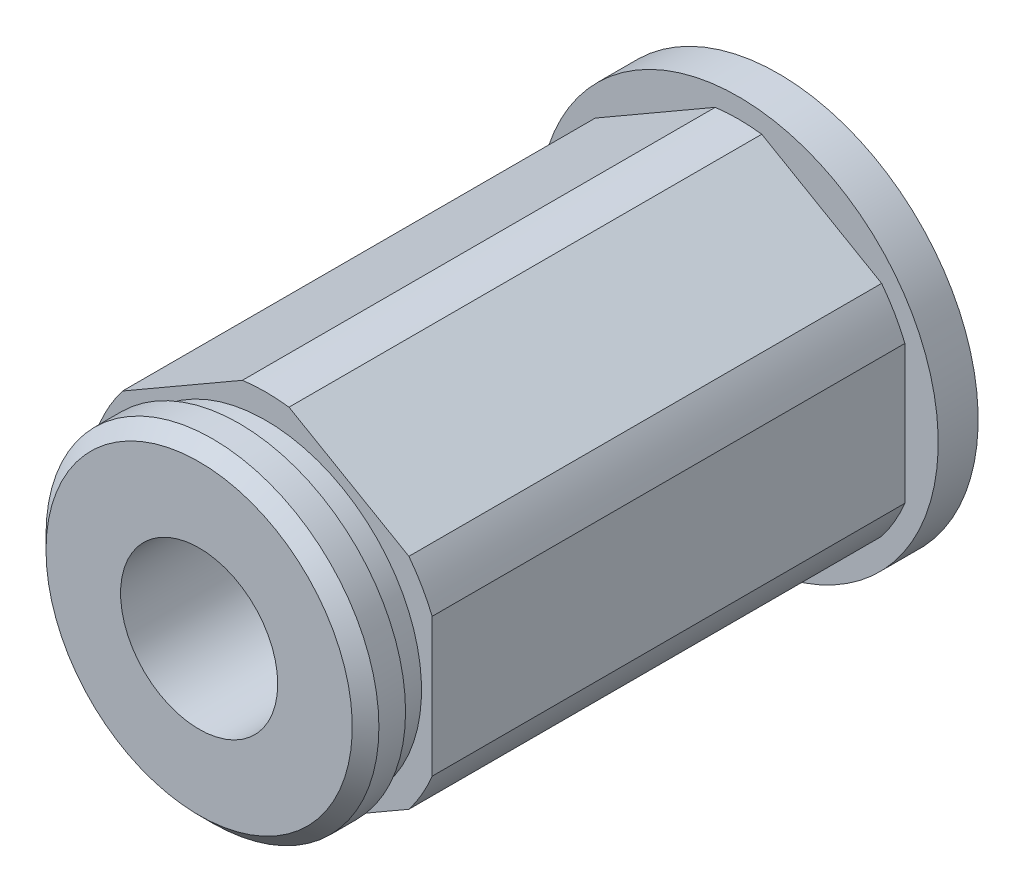
ISO-10303-21;
HEADER;
FILE_DESCRIPTION(('STEP AP214'),'2;1');
FILE_NAME('part.step','',(''),(''),'','','');
FILE_SCHEMA(('AUTOMOTIVE_DESIGN { 1 0 10303 214 1 1 1 1 }'));
ENDSEC;
DATA;
#1=APPLICATION_CONTEXT('core data for automotive mechanical design processes');
#2=APPLICATION_PROTOCOL_DEFINITION('international standard','automotive_design',2000,#1);
#3=PRODUCT_CONTEXT('',#1,'mechanical');
#4=PRODUCT('Part','Part','',(#3));
#5=PRODUCT_RELATED_PRODUCT_CATEGORY('part','',(#4));
#6=PRODUCT_DEFINITION_FORMATION('','',#4);
#7=PRODUCT_DEFINITION_CONTEXT('part definition',#1,'design');
#8=PRODUCT_DEFINITION('design','',#6,#7);
#9=PRODUCT_DEFINITION_SHAPE('','',#8);
#10=(LENGTH_UNIT() NAMED_UNIT(*) SI_UNIT(.MILLI.,.METRE.));
#11=(NAMED_UNIT(*) PLANE_ANGLE_UNIT() SI_UNIT($,.RADIAN.));
#12=(NAMED_UNIT(*) SI_UNIT($,.STERADIAN.) SOLID_ANGLE_UNIT());
#13=UNCERTAINTY_MEASURE_WITH_UNIT(LENGTH_MEASURE(1.E-05),#10,'distance_accuracy_value','');
#14=(GEOMETRIC_REPRESENTATION_CONTEXT(3) GLOBAL_UNCERTAINTY_ASSIGNED_CONTEXT((#13)) GLOBAL_UNIT_ASSIGNED_CONTEXT((#10,
#11,#12)) REPRESENTATION_CONTEXT('',''));
#15=CARTESIAN_POINT('',(0.,0.,0.));
#16=DIRECTION('',(0.,0.,1.));
#17=DIRECTION('',(1.,0.,0.));
#18=AXIS2_PLACEMENT_3D('',#15,#16,#17);
#19=CARTESIAN_POINT('',(-0.88841137786549,6.81942387054648,9.779));
#20=DIRECTION('',(0.5,-0.866025403784439,0.));
#21=DIRECTION('',(0.866025403784439,0.5,0.));
#22=AXIS2_PLACEMENT_3D('',#19,#20,#21);
#23=PLANE('',#22);
#24=DIRECTION('',(0.866025403784439,0.5,0.));
#25=VECTOR('',#24,1.);
#26=CARTESIAN_POINT('',(-0.88841137786549,6.81942387054648,-8.255));
#27=LINE('',#26,#25);
#28=CARTESIAN_POINT('',(-5.46158862213451,4.17909875751589,-8.255));
#29=VERTEX_POINT('',#28);
#30=CARTESIAN_POINT('',(-0.88841137786549,6.81942387054648,-8.255));
#31=VERTEX_POINT('',#30);
#32=EDGE_CURVE('E164',#29,#31,#27,.T.);
#33=ORIENTED_EDGE('',*,*,#32,.F.);
#34=DIRECTION('',(0.,0.,-1.));
#35=VECTOR('',#34,1.);
#36=CARTESIAN_POINT('',(-5.46158862213451,4.17909875751589,9.779));
#37=LINE('',#36,#35);
#38=CARTESIAN_POINT('',(-5.46158862213451,4.17909875751589,9.779));
#39=VERTEX_POINT('',#38);
#40=EDGE_CURVE('E46',#39,#29,#37,.T.);
#41=ORIENTED_EDGE('',*,*,#40,.F.);
#42=DIRECTION('',(-0.866025403784439,-0.5,0.));
#43=VECTOR('',#42,1.);
#44=CARTESIAN_POINT('',(-0.88841137786549,6.81942387054648,9.779));
#45=LINE('',#44,#43);
#46=CARTESIAN_POINT('',(-0.88841137786549,6.81942387054648,9.779));
#47=VERTEX_POINT('',#46);
#48=EDGE_CURVE('E205',#47,#39,#45,.T.);
#49=ORIENTED_EDGE('',*,*,#48,.F.);
#50=DIRECTION('',(0.,0.,-1.));
#51=VECTOR('',#50,1.);
#52=CARTESIAN_POINT('',(-0.88841137786549,6.81942387054648,9.779));
#53=LINE('',#52,#51);
#54=EDGE_CURVE('E11',#47,#31,#53,.T.);
#55=ORIENTED_EDGE('',*,*,#54,.T.);
#56=EDGE_LOOP('',(#33,#41,#49,#55));
#57=FACE_BOUND('',#56,.T.);
#58=ADVANCED_FACE('F38',(#57),#23,.F.);
#59=CARTESIAN_POINT('',(-6.35,2.64032511303059,9.779));
#60=DIRECTION('',(1.,0.,0.));
#61=DIRECTION('',(0.,0.,-1.));
#62=AXIS2_PLACEMENT_3D('',#59,#60,#61);
#63=PLANE('',#62);
#64=DIRECTION('',(0.,1.,0.));
#65=VECTOR('',#64,1.);
#66=CARTESIAN_POINT('',(-6.35,2.64032511303059,-8.255));
#67=LINE('',#66,#65);
#68=CARTESIAN_POINT('',(-6.35,-2.64032511303059,-8.255));
#69=VERTEX_POINT('',#68);
#70=CARTESIAN_POINT('',(-6.35,2.64032511303059,-8.255));
#71=VERTEX_POINT('',#70);
#72=EDGE_CURVE('E175',#69,#71,#67,.T.);
#73=ORIENTED_EDGE('',*,*,#72,.F.);
#74=DIRECTION('',(0.,0.,-1.));
#75=VECTOR('',#74,1.);
#76=CARTESIAN_POINT('',(-6.35,-2.64032511303059,9.779));
#77=LINE('',#76,#75);
#78=CARTESIAN_POINT('',(-6.35,-2.64032511303059,9.779));
#79=VERTEX_POINT('',#78);
#80=EDGE_CURVE('E243',#79,#69,#77,.T.);
#81=ORIENTED_EDGE('',*,*,#80,.F.);
#82=DIRECTION('',(0.,-1.,0.));
#83=VECTOR('',#82,1.);
#84=CARTESIAN_POINT('',(-6.35,2.64032511303059,9.779));
#85=LINE('',#84,#83);
#86=CARTESIAN_POINT('',(-6.35,2.64032511303059,9.779));
#87=VERTEX_POINT('',#86);
#88=EDGE_CURVE('E209',#87,#79,#85,.T.);
#89=ORIENTED_EDGE('',*,*,#88,.F.);
#90=DIRECTION('',(0.,0.,-1.));
#91=VECTOR('',#90,1.);
#92=CARTESIAN_POINT('',(-6.35,2.64032511303059,9.779));
#93=LINE('',#92,#91);
#94=EDGE_CURVE('E246',#87,#71,#93,.T.);
#95=ORIENTED_EDGE('',*,*,#94,.T.);
#96=EDGE_LOOP('',(#73,#81,#89,#95));
#97=FACE_BOUND('',#96,.T.);
#98=ADVANCED_FACE('F257',(#97),#63,.F.);
#99=CARTESIAN_POINT('',(-5.46158862213451,-4.17909875751589,9.779));
#100=DIRECTION('',(0.5,0.866025403784438,0.));
#101=DIRECTION('',(-0.866025403784439,0.5,0.));
#102=AXIS2_PLACEMENT_3D('',#99,#100,#101);
#103=PLANE('',#102);
#104=DIRECTION('',(-0.866025403784439,0.5,0.));
#105=VECTOR('',#104,1.);
#106=CARTESIAN_POINT('',(-5.46158862213451,-4.17909875751589,-8.255));
#107=LINE('',#106,#105);
#108=CARTESIAN_POINT('',(-0.888411377865495,-6.81942387054648,-8.255));
#109=VERTEX_POINT('',#108);
#110=CARTESIAN_POINT('',(-5.46158862213451,-4.17909875751589,-8.255));
#111=VERTEX_POINT('',#110);
#112=EDGE_CURVE('E173',#109,#111,#107,.T.);
#113=ORIENTED_EDGE('',*,*,#112,.F.);
#114=DIRECTION('',(0.,0.,-1.));
#115=VECTOR('',#114,1.);
#116=CARTESIAN_POINT('',(-0.888411377865495,-6.81942387054648,9.779));
#117=LINE('',#116,#115);
#118=CARTESIAN_POINT('',(-0.888411377865495,-6.81942387054648,9.779));
#119=VERTEX_POINT('',#118);
#120=EDGE_CURVE('E237',#119,#109,#117,.T.);
#121=ORIENTED_EDGE('',*,*,#120,.F.);
#122=DIRECTION('',(0.866025403784438,-0.5,0.));
#123=VECTOR('',#122,1.);
#124=CARTESIAN_POINT('',(-5.46158862213451,-4.17909875751589,9.779));
#125=LINE('',#124,#123);
#126=CARTESIAN_POINT('',(-5.46158862213451,-4.17909875751589,9.779));
#127=VERTEX_POINT('',#126);
#128=EDGE_CURVE('E213',#127,#119,#125,.T.);
#129=ORIENTED_EDGE('',*,*,#128,.F.);
#130=DIRECTION('',(0.,0.,-1.));
#131=VECTOR('',#130,1.);
#132=CARTESIAN_POINT('',(-5.46158862213451,-4.17909875751589,9.779));
#133=LINE('',#132,#131);
#134=EDGE_CURVE('E240',#127,#111,#133,.T.);
#135=ORIENTED_EDGE('',*,*,#134,.T.);
#136=EDGE_LOOP('',(#113,#121,#129,#135));
#137=FACE_BOUND('',#136,.T.);
#138=ADVANCED_FACE('F282',(#137),#103,.F.);
#139=CARTESIAN_POINT('',(0.88841137786549,-6.81942387054648,9.779));
#140=DIRECTION('',(-0.5,0.866025403784439,0.));
#141=DIRECTION('',(-0.866025403784439,-0.5,0.));
#142=AXIS2_PLACEMENT_3D('',#139,#140,#141);
#143=PLANE('',#142);
#144=DIRECTION('',(-0.866025403784439,-0.5,0.));
#145=VECTOR('',#144,1.);
#146=CARTESIAN_POINT('',(0.88841137786549,-6.81942387054648,-8.255));
#147=LINE('',#146,#145);
#148=CARTESIAN_POINT('',(5.46158862213451,-4.17909875751589,-8.255));
#149=VERTEX_POINT('',#148);
#150=CARTESIAN_POINT('',(0.888411377865487,-6.81942387054648,-8.255));
#151=VERTEX_POINT('',#150);
#152=EDGE_CURVE('E161',#149,#151,#147,.T.);
#153=ORIENTED_EDGE('',*,*,#152,.F.);
#154=DIRECTION('',(0.,0.,-1.));
#155=VECTOR('',#154,1.);
#156=CARTESIAN_POINT('',(5.46158862213451,-4.17909875751589,9.779));
#157=LINE('',#156,#155);
#158=CARTESIAN_POINT('',(5.46158862213451,-4.17909875751589,9.779));
#159=VERTEX_POINT('',#158);
#160=EDGE_CURVE('E231',#159,#149,#157,.T.);
#161=ORIENTED_EDGE('',*,*,#160,.F.);
#162=DIRECTION('',(0.866025403784439,0.5,0.));
#163=VECTOR('',#162,1.);
#164=CARTESIAN_POINT('',(0.88841137786549,-6.81942387054648,9.779));
#165=LINE('',#164,#163);
#166=CARTESIAN_POINT('',(0.888411377865487,-6.81942387054648,9.779));
#167=VERTEX_POINT('',#166);
#168=EDGE_CURVE('E217',#167,#159,#165,.T.);
#169=ORIENTED_EDGE('',*,*,#168,.F.);
#170=DIRECTION('',(0.,0.,-1.));
#171=VECTOR('',#170,1.);
#172=CARTESIAN_POINT('',(0.888411377865487,-6.81942387054648,9.779));
#173=LINE('',#172,#171);
#174=EDGE_CURVE('E234',#167,#151,#173,.T.);
#175=ORIENTED_EDGE('',*,*,#174,.T.);
#176=EDGE_LOOP('',(#153,#161,#169,#175));
#177=FACE_BOUND('',#176,.T.);
#178=ADVANCED_FACE('F276',(#177),#143,.F.);
#179=CARTESIAN_POINT('',(6.35,-2.64032511303059,9.779));
#180=DIRECTION('',(-1.,0.,0.));
#181=DIRECTION('',(0.,0.,1.));
#182=AXIS2_PLACEMENT_3D('',#179,#180,#181);
#183=PLANE('',#182);
#184=DIRECTION('',(0.,-1.,0.));
#185=VECTOR('',#184,1.);
#186=CARTESIAN_POINT('',(6.35,-2.64032511303059,-8.255));
#187=LINE('',#186,#185);
#188=CARTESIAN_POINT('',(6.35,2.64032511303059,-8.255));
#189=VERTEX_POINT('',#188);
#190=CARTESIAN_POINT('',(6.35,-2.64032511303059,-8.255));
#191=VERTEX_POINT('',#190);
#192=EDGE_CURVE('E142',#189,#191,#187,.T.);
#193=ORIENTED_EDGE('',*,*,#192,.F.);
#194=DIRECTION('',(0.,0.,-1.));
#195=VECTOR('',#194,1.);
#196=CARTESIAN_POINT('',(6.35,2.64032511303059,9.779));
#197=LINE('',#196,#195);
#198=CARTESIAN_POINT('',(6.35,2.64032511303059,9.779));
#199=VERTEX_POINT('',#198);
#200=EDGE_CURVE('E129',#199,#189,#197,.T.);
#201=ORIENTED_EDGE('',*,*,#200,.F.);
#202=DIRECTION('',(0.,1.,0.));
#203=VECTOR('',#202,1.);
#204=CARTESIAN_POINT('',(6.35,-2.64032511303059,9.779));
#205=LINE('',#204,#203);
#206=CARTESIAN_POINT('',(6.35,-2.64032511303059,9.779));
#207=VERTEX_POINT('',#206);
#208=EDGE_CURVE('E222',#207,#199,#205,.T.);
#209=ORIENTED_EDGE('',*,*,#208,.F.);
#210=DIRECTION('',(0.,0.,-1.));
#211=VECTOR('',#210,1.);
#212=CARTESIAN_POINT('',(6.35,-2.64032511303059,9.779));
#213=LINE('',#212,#211);
#214=EDGE_CURVE('E137',#207,#191,#213,.T.);
#215=ORIENTED_EDGE('',*,*,#214,.T.);
#216=EDGE_LOOP('',(#193,#201,#209,#215));
#217=FACE_BOUND('',#216,.T.);
#218=ADVANCED_FACE('F143',(#217),#183,.F.);
#219=CARTESIAN_POINT('',(5.46158862213451,4.17909875751589,9.779));
#220=DIRECTION('',(-0.499999999999999,-0.866025403784439,0.));
#221=DIRECTION('',(0.866025403784439,-0.499999999999999,0.));
#222=AXIS2_PLACEMENT_3D('',#219,#220,#221);
#223=PLANE('',#222);
#224=DIRECTION('',(0.866025403784439,-0.499999999999999,0.));
#225=VECTOR('',#224,1.);
#226=CARTESIAN_POINT('',(5.46158862213451,4.17909875751589,-8.255));
#227=LINE('',#226,#225);
#228=CARTESIAN_POINT('',(0.888411377865485,6.81942387054648,-8.255));
#229=VERTEX_POINT('',#228);
#230=CARTESIAN_POINT('',(5.46158862213451,4.17909875751589,-8.255));
#231=VERTEX_POINT('',#230);
#232=EDGE_CURVE('E53',#229,#231,#227,.T.);
#233=ORIENTED_EDGE('',*,*,#232,.F.);
#234=DIRECTION('',(0.,0.,-1.));
#235=VECTOR('',#234,1.);
#236=CARTESIAN_POINT('',(0.888411377865485,6.81942387054648,9.779));
#237=LINE('',#236,#235);
#238=CARTESIAN_POINT('',(0.888411377865485,6.81942387054648,9.779));
#239=VERTEX_POINT('',#238);
#240=EDGE_CURVE('E227',#239,#229,#237,.T.);
#241=ORIENTED_EDGE('',*,*,#240,.F.);
#242=DIRECTION('',(-0.866025403784439,0.499999999999999,0.));
#243=VECTOR('',#242,1.);
#244=CARTESIAN_POINT('',(5.46158862213451,4.17909875751589,9.779));
#245=LINE('',#244,#243);
#246=CARTESIAN_POINT('',(5.46158862213451,4.17909875751589,9.779));
#247=VERTEX_POINT('',#246);
#248=EDGE_CURVE('E225',#247,#239,#245,.T.);
#249=ORIENTED_EDGE('',*,*,#248,.F.);
#250=DIRECTION('',(0.,0.,-1.));
#251=VECTOR('',#250,1.);
#252=CARTESIAN_POINT('',(5.46158862213451,4.17909875751589,9.779));
#253=LINE('',#252,#251);
#254=EDGE_CURVE('E138',#247,#231,#253,.T.);
#255=ORIENTED_EDGE('',*,*,#254,.T.);
#256=EDGE_LOOP('',(#233,#241,#249,#255));
#257=FACE_BOUND('',#256,.T.);
#258=ADVANCED_FACE('F269',(#257),#223,.F.);
#259=CARTESIAN_POINT('',(0.,0.,9.779));
#260=DIRECTION('',(0.,0.,-1.));
#261=DIRECTION('',(-1.,0.,0.));
#262=AXIS2_PLACEMENT_3D('',#259,#260,#261);
#263=CYLINDRICAL_SURFACE('',#262,6.87705);
#264=CARTESIAN_POINT('',(0.,0.,-8.255));
#265=DIRECTION('',(0.,0.,-1.));
#266=DIRECTION('',(-1.,0.,0.));
#267=AXIS2_PLACEMENT_3D('',#264,#265,#266);
#268=CIRCLE('',#267,6.87705);
#269=EDGE_CURVE('E60',#31,#229,#268,.T.);
#270=ORIENTED_EDGE('',*,*,#269,.F.);
#271=ORIENTED_EDGE('',*,*,#54,.F.);
#272=CARTESIAN_POINT('',(0.,0.,9.779));
#273=DIRECTION('',(0.,0.,1.));
#274=DIRECTION('',(1.,0.,0.));
#275=AXIS2_PLACEMENT_3D('',#272,#273,#274);
#276=CIRCLE('',#275,6.87705);
#277=EDGE_CURVE('E202',#239,#47,#276,.T.);
#278=ORIENTED_EDGE('',*,*,#277,.F.);
#279=ORIENTED_EDGE('',*,*,#240,.T.);
#280=EDGE_LOOP('',(#270,#271,#278,#279));
#281=FACE_BOUND('',#280,.T.);
#282=ADVANCED_FACE('F267',(#281),#263,.T.);
#283=CARTESIAN_POINT('',(0.,0.,9.779));
#284=DIRECTION('',(0.,0.,-1.));
#285=DIRECTION('',(-1.,0.,0.));
#286=AXIS2_PLACEMENT_3D('',#283,#284,#285);
#287=CYLINDRICAL_SURFACE('',#286,6.87705);
#288=CARTESIAN_POINT('',(0.,0.,-8.255));
#289=DIRECTION('',(0.,0.,-1.));
#290=DIRECTION('',(-1.,0.,0.));
#291=AXIS2_PLACEMENT_3D('',#288,#289,#290);
#292=CIRCLE('',#291,6.87705);
#293=EDGE_CURVE('E170',#71,#29,#292,.T.);
#294=ORIENTED_EDGE('',*,*,#293,.F.);
#295=ORIENTED_EDGE('',*,*,#94,.F.);
#296=CARTESIAN_POINT('',(0.,0.,9.779));
#297=DIRECTION('',(0.,0.,1.));
#298=DIRECTION('',(1.,0.,0.));
#299=AXIS2_PLACEMENT_3D('',#296,#297,#298);
#300=CIRCLE('',#299,6.87705);
#301=EDGE_CURVE('E207',#39,#87,#300,.T.);
#302=ORIENTED_EDGE('',*,*,#301,.F.);
#303=ORIENTED_EDGE('',*,*,#40,.T.);
#304=EDGE_LOOP('',(#294,#295,#302,#303));
#305=FACE_BOUND('',#304,.T.);
#306=ADVANCED_FACE('F252',(#305),#287,.T.);
#307=CARTESIAN_POINT('',(0.,0.,9.779));
#308=DIRECTION('',(0.,0.,-1.));
#309=DIRECTION('',(-1.,0.,0.));
#310=AXIS2_PLACEMENT_3D('',#307,#308,#309);
#311=CYLINDRICAL_SURFACE('',#310,6.87705);
#312=CARTESIAN_POINT('',(0.,0.,-8.255));
#313=DIRECTION('',(0.,0.,-1.));
#314=DIRECTION('',(-1.,0.,0.));
#315=AXIS2_PLACEMENT_3D('',#312,#313,#314);
#316=CIRCLE('',#315,6.87705);
#317=EDGE_CURVE('E178',#111,#69,#316,.T.);
#318=ORIENTED_EDGE('',*,*,#317,.F.);
#319=ORIENTED_EDGE('',*,*,#134,.F.);
#320=CARTESIAN_POINT('',(0.,0.,9.779));
#321=DIRECTION('',(0.,0.,1.));
#322=DIRECTION('',(1.,0.,0.));
#323=AXIS2_PLACEMENT_3D('',#320,#321,#322);
#324=CIRCLE('',#323,6.87705);
#325=EDGE_CURVE('E211',#79,#127,#324,.T.);
#326=ORIENTED_EDGE('',*,*,#325,.F.);
#327=ORIENTED_EDGE('',*,*,#80,.T.);
#328=EDGE_LOOP('',(#318,#319,#326,#327));
#329=FACE_BOUND('',#328,.T.);
#330=ADVANCED_FACE('F261',(#329),#311,.T.);
#331=CARTESIAN_POINT('',(0.,0.,9.779));
#332=DIRECTION('',(0.,0.,-1.));
#333=DIRECTION('',(-1.,0.,0.));
#334=AXIS2_PLACEMENT_3D('',#331,#332,#333);
#335=CYLINDRICAL_SURFACE('',#334,6.87705);
#336=CARTESIAN_POINT('',(0.,0.,-8.255));
#337=DIRECTION('',(0.,0.,-1.));
#338=DIRECTION('',(-1.,0.,0.));
#339=AXIS2_PLACEMENT_3D('',#336,#337,#338);
#340=CIRCLE('',#339,6.87705);
#341=EDGE_CURVE('E167',#151,#109,#340,.T.);
#342=ORIENTED_EDGE('',*,*,#341,.F.);
#343=ORIENTED_EDGE('',*,*,#174,.F.);
#344=CARTESIAN_POINT('',(0.,0.,9.779));
#345=DIRECTION('',(0.,0.,1.));
#346=DIRECTION('',(1.,0.,0.));
#347=AXIS2_PLACEMENT_3D('',#344,#345,#346);
#348=CIRCLE('',#347,6.87705);
#349=EDGE_CURVE('E215',#119,#167,#348,.T.);
#350=ORIENTED_EDGE('',*,*,#349,.F.);
#351=ORIENTED_EDGE('',*,*,#120,.T.);
#352=EDGE_LOOP('',(#342,#343,#350,#351));
#353=FACE_BOUND('',#352,.T.);
#354=ADVANCED_FACE('F280',(#353),#335,.T.);
#355=CARTESIAN_POINT('',(0.,0.,9.779));
#356=DIRECTION('',(0.,0.,-1.));
#357=DIRECTION('',(-1.,0.,0.));
#358=AXIS2_PLACEMENT_3D('',#355,#356,#357);
#359=CYLINDRICAL_SURFACE('',#358,6.87705);
#360=CARTESIAN_POINT('',(0.,0.,-8.255));
#361=DIRECTION('',(0.,0.,-1.));
#362=DIRECTION('',(-1.,0.,0.));
#363=AXIS2_PLACEMENT_3D('',#360,#361,#362);
#364=CIRCLE('',#363,6.87705);
#365=EDGE_CURVE('E147',#191,#149,#364,.T.);
#366=ORIENTED_EDGE('',*,*,#365,.F.);
#367=ORIENTED_EDGE('',*,*,#214,.F.);
#368=CARTESIAN_POINT('',(0.,0.,9.779));
#369=DIRECTION('',(0.,0.,1.));
#370=DIRECTION('',(1.,0.,0.));
#371=AXIS2_PLACEMENT_3D('',#368,#369,#370);
#372=CIRCLE('',#371,6.87705);
#373=EDGE_CURVE('E219',#159,#207,#372,.T.);
#374=ORIENTED_EDGE('',*,*,#373,.F.);
#375=ORIENTED_EDGE('',*,*,#160,.T.);
#376=EDGE_LOOP('',(#366,#367,#374,#375));
#377=FACE_BOUND('',#376,.T.);
#378=ADVANCED_FACE('F274',(#377),#359,.T.);
#379=CARTESIAN_POINT('',(0.,0.,9.779));
#380=DIRECTION('',(0.,0.,-1.));
#381=DIRECTION('',(-1.,0.,0.));
#382=AXIS2_PLACEMENT_3D('',#379,#380,#381);
#383=CYLINDRICAL_SURFACE('',#382,6.87705);
#384=CARTESIAN_POINT('',(0.,0.,-8.255));
#385=DIRECTION('',(0.,0.,-1.));
#386=DIRECTION('',(-1.,0.,0.));
#387=AXIS2_PLACEMENT_3D('',#384,#385,#386);
#388=CIRCLE('',#387,6.87705);
#389=EDGE_CURVE('E134',#231,#189,#388,.T.);
#390=ORIENTED_EDGE('',*,*,#389,.F.);
#391=ORIENTED_EDGE('',*,*,#254,.F.);
#392=CARTESIAN_POINT('',(0.,0.,9.779));
#393=DIRECTION('',(0.,0.,1.));
#394=DIRECTION('',(1.,0.,0.));
#395=AXIS2_PLACEMENT_3D('',#392,#393,#394);
#396=CIRCLE('',#395,6.87705);
#397=EDGE_CURVE('E135',#199,#247,#396,.T.);
#398=ORIENTED_EDGE('',*,*,#397,.F.);
#399=ORIENTED_EDGE('',*,*,#200,.T.);
#400=EDGE_LOOP('',(#390,#391,#398,#399));
#401=FACE_BOUND('',#400,.T.);
#402=ADVANCED_FACE('F131',(#401),#383,.T.);
#403=CARTESIAN_POINT('',(0.,0.,9.779));
#404=DIRECTION('',(0.,0.,1.));
#405=DIRECTION('',(1.,0.,0.));
#406=AXIS2_PLACEMENT_3D('',#403,#404,#405);
#407=PLANE('',#406);
#408=CARTESIAN_POINT('',(0.,0.,9.779));
#409=DIRECTION('',(0.,0.,-1.));
#410=DIRECTION('',(-1.,0.,0.));
#411=AXIS2_PLACEMENT_3D('',#408,#409,#410);
#412=CIRCLE('',#411,5.9436);
#413=CARTESIAN_POINT('',(-5.9436,0.,9.779));
#414=VERTEX_POINT('',#413);
#415=EDGE_CURVE('E199',#414,#414,#412,.T.);
#416=ORIENTED_EDGE('',*,*,#415,.T.);
#417=EDGE_LOOP('',(#416));
#418=FACE_BOUND('',#417,.T.);
#419=ORIENTED_EDGE('',*,*,#373,.T.);
#420=ORIENTED_EDGE('',*,*,#208,.T.);
#421=ORIENTED_EDGE('',*,*,#397,.T.);
#422=ORIENTED_EDGE('',*,*,#248,.T.);
#423=ORIENTED_EDGE('',*,*,#277,.T.);
#424=ORIENTED_EDGE('',*,*,#48,.T.);
#425=ORIENTED_EDGE('',*,*,#301,.T.);
#426=ORIENTED_EDGE('',*,*,#88,.T.);
#427=ORIENTED_EDGE('',*,*,#325,.T.);
#428=ORIENTED_EDGE('',*,*,#128,.T.);
#429=ORIENTED_EDGE('',*,*,#349,.T.);
#430=ORIENTED_EDGE('',*,*,#168,.T.);
#431=EDGE_LOOP('',(#419,#420,#421,#422,#423,#424,#425,#426,#427,#428,#429,#430));
#432=FACE_BOUND('',#431,.T.);
#433=ADVANCED_FACE('F40',(#418,#432),#407,.T.);
#434=CARTESIAN_POINT('',(0.,0.,-9.779));
#435=DIRECTION('',(0.,0.,1.));
#436=DIRECTION('',(1.,0.,0.));
#437=AXIS2_PLACEMENT_3D('',#434,#435,#436);
#438=PLANE('',#437);
#439=CARTESIAN_POINT('',(0.,0.,-9.779));
#440=DIRECTION('',(0.,0.,1.));
#441=DIRECTION('',(1.,0.,0.));
#442=AXIS2_PLACEMENT_3D('',#439,#440,#441);
#443=CIRCLE('',#442,2.9972);
#444=CARTESIAN_POINT('',(2.9972,0.,-9.779));
#445=VERTEX_POINT('',#444);
#446=EDGE_CURVE('E184',#445,#445,#443,.T.);
#447=ORIENTED_EDGE('',*,*,#446,.T.);
#448=EDGE_LOOP('',(#447));
#449=FACE_BOUND('',#448,.T.);
#450=CARTESIAN_POINT('',(0.,0.,-9.779));
#451=DIRECTION('',(0.,0.,-1.));
#452=DIRECTION('',(-1.,0.,0.));
#453=AXIS2_PLACEMENT_3D('',#450,#451,#452);
#454=CIRCLE('',#453,7.62);
#455=CARTESIAN_POINT('',(-7.62,0.,-9.779));
#456=VERTEX_POINT('',#455);
#457=EDGE_CURVE('E155',#456,#456,#454,.T.);
#458=ORIENTED_EDGE('',*,*,#457,.T.);
#459=EDGE_LOOP('',(#458));
#460=FACE_BOUND('',#459,.T.);
#461=ADVANCED_FACE('F300',(#449,#460),#438,.F.);
#462=CARTESIAN_POINT('',(0.,0.,-38.2778));
#463=DIRECTION('',(0.,0.,-1.));
#464=DIRECTION('',(-1.,0.,0.));
#465=AXIS2_PLACEMENT_3D('',#462,#463,#464);
#466=CYLINDRICAL_SURFACE('',#465,5.9436);
#467=CARTESIAN_POINT('',(0.,0.,10.795));
#468=DIRECTION('',(0.,0.,-1.));
#469=DIRECTION('',(-1.,0.,0.));
#470=AXIS2_PLACEMENT_3D('',#467,#468,#469);
#471=CIRCLE('',#470,5.9436);
#472=CARTESIAN_POINT('',(-5.9436,0.,10.795));
#473=VERTEX_POINT('',#472);
#474=EDGE_CURVE('E196',#473,#473,#471,.T.);
#475=ORIENTED_EDGE('',*,*,#474,.T.);
#476=EDGE_LOOP('',(#475));
#477=FACE_BOUND('',#476,.T.);
#478=ORIENTED_EDGE('',*,*,#415,.F.);
#479=EDGE_LOOP('',(#478));
#480=FACE_BOUND('',#479,.T.);
#481=ADVANCED_FACE('F302',(#477,#480),#466,.T.);
#482=CARTESIAN_POINT('',(0.,5.9436,10.795));
#483=DIRECTION('',(0.,0.,-1.));
#484=DIRECTION('',(-1.,0.,0.));
#485=AXIS2_PLACEMENT_3D('',#482,#483,#484);
#486=PLANE('',#485);
#487=CARTESIAN_POINT('',(0.,0.,10.795));
#488=DIRECTION('',(0.,0.,-1.));
#489=DIRECTION('',(-1.,0.,0.));
#490=AXIS2_PLACEMENT_3D('',#487,#488,#489);
#491=CIRCLE('',#490,6.35);
#492=CARTESIAN_POINT('',(-6.35,0.,10.795));
#493=VERTEX_POINT('',#492);
#494=EDGE_CURVE('E193',#493,#493,#491,.T.);
#495=ORIENTED_EDGE('',*,*,#494,.T.);
#496=EDGE_LOOP('',(#495));
#497=FACE_BOUND('',#496,.T.);
#498=ORIENTED_EDGE('',*,*,#474,.F.);
#499=EDGE_LOOP('',(#498));
#500=FACE_BOUND('',#499,.T.);
#501=ADVANCED_FACE('F308',(#497,#500),#486,.T.);
#502=CARTESIAN_POINT('',(0.,0.,-38.2778));
#503=DIRECTION('',(0.,0.,-1.));
#504=DIRECTION('',(-1.,0.,0.));
#505=AXIS2_PLACEMENT_3D('',#502,#503,#504);
#506=CYLINDRICAL_SURFACE('',#505,6.35);
#507=CARTESIAN_POINT('',(0.,0.,11.811));
#508=DIRECTION('',(0.,0.,-1.));
#509=DIRECTION('',(-1.,0.,0.));
#510=AXIS2_PLACEMENT_3D('',#507,#508,#509);
#511=CIRCLE('',#510,6.35);
#512=CARTESIAN_POINT('',(-6.35,0.,11.811));
#513=VERTEX_POINT('',#512);
#514=EDGE_CURVE('E190',#513,#513,#511,.T.);
#515=ORIENTED_EDGE('',*,*,#514,.T.);
#516=EDGE_LOOP('',(#515));
#517=FACE_BOUND('',#516,.T.);
#518=ORIENTED_EDGE('',*,*,#494,.F.);
#519=EDGE_LOOP('',(#518));
#520=FACE_BOUND('',#519,.T.);
#521=ADVANCED_FACE('F338',(#517,#520),#506,.T.);
#522=CARTESIAN_POINT('',(0.,0.,11.811));
#523=DIRECTION('',(0.,0.,-1.));
#524=DIRECTION('',(-1.,0.,0.));
#525=AXIS2_PLACEMENT_3D('',#522,#523,#524);
#526=CONICAL_SURFACE('',#525,6.35,0.785398163397453);
#527=CARTESIAN_POINT('',(0.,0.,12.319));
#528=DIRECTION('',(0.,0.,-1.));
#529=DIRECTION('',(-1.,0.,0.));
#530=AXIS2_PLACEMENT_3D('',#527,#528,#529);
#531=CIRCLE('',#530,5.842);
#532=CARTESIAN_POINT('',(-5.842,0.,12.319));
#533=VERTEX_POINT('',#532);
#534=EDGE_CURVE('E187',#533,#533,#531,.T.);
#535=ORIENTED_EDGE('',*,*,#534,.T.);
#536=EDGE_LOOP('',(#535));
#537=FACE_BOUND('',#536,.T.);
#538=ORIENTED_EDGE('',*,*,#514,.F.);
#539=EDGE_LOOP('',(#538));
#540=FACE_BOUND('',#539,.T.);
#541=ADVANCED_FACE('F334',(#537,#540),#526,.T.);
#542=CARTESIAN_POINT('',(0.,5.842,12.319));
#543=DIRECTION('',(0.,0.,1.));
#544=DIRECTION('',(1.,0.,0.));
#545=AXIS2_PLACEMENT_3D('',#542,#543,#544);
#546=PLANE('',#545);
#547=CARTESIAN_POINT('',(0.,0.,12.319));
#548=DIRECTION('',(0.,0.,1.));
#549=DIRECTION('',(1.,0.,0.));
#550=AXIS2_PLACEMENT_3D('',#547,#548,#549);
#551=CIRCLE('',#550,2.9972);
#552=CARTESIAN_POINT('',(2.9972,0.,12.319));
#553=VERTEX_POINT('',#552);
#554=EDGE_CURVE('E181',#553,#553,#551,.T.);
#555=ORIENTED_EDGE('',*,*,#554,.F.);
#556=EDGE_LOOP('',(#555));
#557=FACE_BOUND('',#556,.T.);
#558=ORIENTED_EDGE('',*,*,#534,.F.);
#559=EDGE_LOOP('',(#558));
#560=FACE_BOUND('',#559,.T.);
#561=ADVANCED_FACE('F330',(#557,#560),#546,.T.);
#562=CARTESIAN_POINT('',(0.,0.,-9.779));
#563=DIRECTION('',(0.,0.,1.));
#564=DIRECTION('',(1.,0.,0.));
#565=AXIS2_PLACEMENT_3D('',#562,#563,#564);
#566=CYLINDRICAL_SURFACE('',#565,2.9972);
#567=ORIENTED_EDGE('',*,*,#446,.F.);
#568=EDGE_LOOP('',(#567));
#569=FACE_BOUND('',#568,.T.);
#570=ORIENTED_EDGE('',*,*,#554,.T.);
#571=EDGE_LOOP('',(#570));
#572=FACE_BOUND('',#571,.T.);
#573=ADVANCED_FACE('F324',(#569,#572),#566,.F.);
#574=CARTESIAN_POINT('',(0.,0.,-8.255));
#575=DIRECTION('',(0.,0.,-1.));
#576=DIRECTION('',(-1.,0.,0.));
#577=AXIS2_PLACEMENT_3D('',#574,#575,#576);
#578=PLANE('',#577);
#579=CARTESIAN_POINT('',(0.,0.,-8.255));
#580=DIRECTION('',(0.,0.,-1.));
#581=DIRECTION('',(-1.,0.,0.));
#582=AXIS2_PLACEMENT_3D('',#579,#580,#581);
#583=CIRCLE('',#582,7.62);
#584=CARTESIAN_POINT('',(-7.62,0.,-8.255));
#585=VERTEX_POINT('',#584);
#586=EDGE_CURVE('E151',#585,#585,#583,.T.);
#587=ORIENTED_EDGE('',*,*,#586,.F.);
#588=EDGE_LOOP('',(#587));
#589=FACE_BOUND('',#588,.T.);
#590=ORIENTED_EDGE('',*,*,#112,.T.);
#591=ORIENTED_EDGE('',*,*,#317,.T.);
#592=ORIENTED_EDGE('',*,*,#72,.T.);
#593=ORIENTED_EDGE('',*,*,#293,.T.);
#594=ORIENTED_EDGE('',*,*,#32,.T.);
#595=ORIENTED_EDGE('',*,*,#269,.T.);
#596=ORIENTED_EDGE('',*,*,#232,.T.);
#597=ORIENTED_EDGE('',*,*,#389,.T.);
#598=ORIENTED_EDGE('',*,*,#192,.T.);
#599=ORIENTED_EDGE('',*,*,#365,.T.);
#600=ORIENTED_EDGE('',*,*,#152,.T.);
#601=ORIENTED_EDGE('',*,*,#341,.T.);
#602=EDGE_LOOP('',(#590,#591,#592,#593,#594,#595,#596,#597,#598,#599,#600,#601));
#603=FACE_BOUND('',#602,.T.);
#604=ADVANCED_FACE('F150',(#589,#603),#578,.F.);
#605=CARTESIAN_POINT('',(0.,0.,-8.255));
#606=DIRECTION('',(0.,0.,-1.));
#607=DIRECTION('',(-1.,0.,0.));
#608=AXIS2_PLACEMENT_3D('',#605,#606,#607);
#609=CYLINDRICAL_SURFACE('',#608,7.62);
#610=ORIENTED_EDGE('',*,*,#586,.T.);
#611=EDGE_LOOP('',(#610));
#612=FACE_BOUND('',#611,.T.);
#613=ORIENTED_EDGE('',*,*,#457,.F.);
#614=EDGE_LOOP('',(#613));
#615=FACE_BOUND('',#614,.T.);
#616=ADVANCED_FACE('F317',(#612,#615),#609,.T.);
#617=CLOSED_SHELL('',(#58,#98,#138,#178,#218,#258,#282,#306,#330,#354,#378,#402,#433,#461,#481,
#501,#521,#541,#561,#573,#604,#616));
#618=MANIFOLD_SOLID_BREP('B2',#617);
#619=ADVANCED_BREP_SHAPE_REPRESENTATION('',(#18,#618),#14);
#620=SHAPE_DEFINITION_REPRESENTATION(#9,#619);
ENDSEC;
END-ISO-10303-21;
